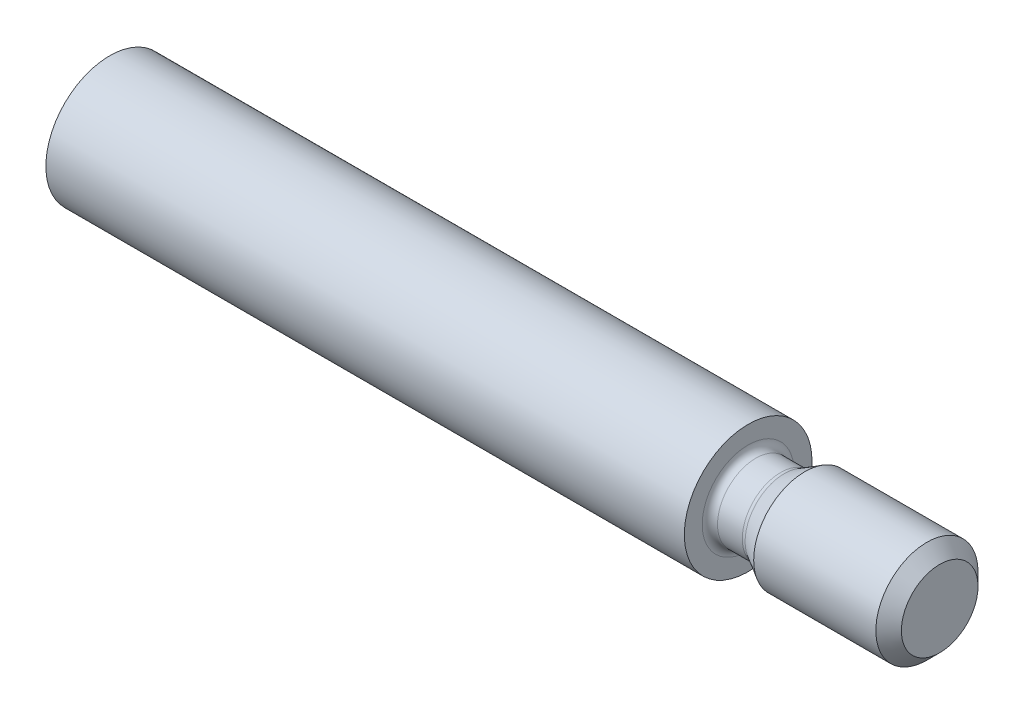
ISO-10303-21;
HEADER;
FILE_DESCRIPTION(('STEP AP214'),'2;1');
FILE_NAME('part.step','',(''),(''),'','','');
FILE_SCHEMA(('AUTOMOTIVE_DESIGN { 1 0 10303 214 1 1 1 1 }'));
ENDSEC;
DATA;
#1=APPLICATION_CONTEXT('core data for automotive mechanical design processes');
#2=APPLICATION_PROTOCOL_DEFINITION('international standard','automotive_design',2000,#1);
#3=PRODUCT_CONTEXT('',#1,'mechanical');
#4=PRODUCT('Part','Part','',(#3));
#5=PRODUCT_RELATED_PRODUCT_CATEGORY('part','',(#4));
#6=PRODUCT_DEFINITION_FORMATION('','',#4);
#7=PRODUCT_DEFINITION_CONTEXT('part definition',#1,'design');
#8=PRODUCT_DEFINITION('design','',#6,#7);
#9=PRODUCT_DEFINITION_SHAPE('','',#8);
#10=(LENGTH_UNIT() NAMED_UNIT(*) SI_UNIT(.MILLI.,.METRE.));
#11=(NAMED_UNIT(*) PLANE_ANGLE_UNIT() SI_UNIT($,.RADIAN.));
#12=(NAMED_UNIT(*) SI_UNIT($,.STERADIAN.) SOLID_ANGLE_UNIT());
#13=UNCERTAINTY_MEASURE_WITH_UNIT(LENGTH_MEASURE(1.E-05),#10,'distance_accuracy_value','');
#14=(GEOMETRIC_REPRESENTATION_CONTEXT(3) GLOBAL_UNCERTAINTY_ASSIGNED_CONTEXT((#13)) GLOBAL_UNIT_ASSIGNED_CONTEXT((#10,
#11,#12)) REPRESENTATION_CONTEXT('',''));
#15=CARTESIAN_POINT('',(0.,0.,0.));
#16=DIRECTION('',(0.,0.,1.));
#17=DIRECTION('',(1.,0.,0.));
#18=AXIS2_PLACEMENT_3D('',#15,#16,#17);
#19=CARTESIAN_POINT('',(50.,0.,0.));
#20=DIRECTION('',(-1.,0.,0.));
#21=DIRECTION('',(0.,0.,1.));
#22=AXIS2_PLACEMENT_3D('',#19,#20,#21);
#23=CYLINDRICAL_SURFACE('',#22,5.);
#24=CARTESIAN_POINT('',(50.,0.,0.));
#25=DIRECTION('',(1.,0.,0.));
#26=DIRECTION('',(0.,0.,-1.));
#27=AXIS2_PLACEMENT_3D('',#24,#25,#26);
#28=CIRCLE('',#27,5.);
#29=CARTESIAN_POINT('',(50.,0.,-5.));
#30=VERTEX_POINT('',#29);
#31=EDGE_CURVE('E62',#30,#30,#28,.T.);
#32=ORIENTED_EDGE('',*,*,#31,.F.);
#33=EDGE_LOOP('',(#32));
#34=FACE_BOUND('',#33,.T.);
#35=CARTESIAN_POINT('',(0.,0.,0.));
#36=DIRECTION('',(1.,0.,0.));
#37=DIRECTION('',(0.,0.,-1.));
#38=AXIS2_PLACEMENT_3D('',#35,#36,#37);
#39=CIRCLE('',#38,5.);
#40=CARTESIAN_POINT('',(0.,0.,-5.));
#41=VERTEX_POINT('',#40);
#42=EDGE_CURVE('E66',#41,#41,#39,.T.);
#43=ORIENTED_EDGE('',*,*,#42,.T.);
#44=EDGE_LOOP('',(#43));
#45=FACE_BOUND('',#44,.T.);
#46=ADVANCED_FACE('F36',(#34,#45),#23,.T.);
#47=CARTESIAN_POINT('',(50.,0.,0.));
#48=DIRECTION('',(1.,0.,0.));
#49=DIRECTION('',(0.,0.,-1.));
#50=AXIS2_PLACEMENT_3D('',#47,#48,#49);
#51=PLANE('',#50);
#52=CARTESIAN_POINT('',(50.,0.,0.));
#53=DIRECTION('',(1.,0.,0.));
#54=DIRECTION('',(0.,0.,-1.));
#55=AXIS2_PLACEMENT_3D('',#52,#53,#54);
#56=CIRCLE('',#55,3.6);
#57=CARTESIAN_POINT('',(50.,0.,-3.6));
#58=VERTEX_POINT('',#57);
#59=EDGE_CURVE('E11',#58,#58,#56,.F.);
#60=ORIENTED_EDGE('',*,*,#59,.T.);
#61=EDGE_LOOP('',(#60));
#62=FACE_BOUND('',#61,.T.);
#63=ORIENTED_EDGE('',*,*,#31,.T.);
#64=EDGE_LOOP('',(#63));
#65=FACE_BOUND('',#64,.T.);
#66=ADVANCED_FACE('F72',(#62,#65),#51,.T.);
#67=CARTESIAN_POINT('',(0.,0.,0.));
#68=DIRECTION('',(1.,0.,0.));
#69=DIRECTION('',(0.,0.,-1.));
#70=AXIS2_PLACEMENT_3D('',#67,#68,#69);
#71=PLANE('',#70);
#72=ORIENTED_EDGE('',*,*,#42,.F.);
#73=EDGE_LOOP('',(#72));
#74=FACE_BOUND('',#73,.T.);
#75=ADVANCED_FACE('F79',(#74),#71,.F.);
#76=CARTESIAN_POINT('',(52.7,0.,0.));
#77=DIRECTION('',(-1.,0.,0.));
#78=DIRECTION('',(0.,0.,1.));
#79=AXIS2_PLACEMENT_3D('',#76,#77,#78);
#80=CYLINDRICAL_SURFACE('',#79,3.);
#81=CARTESIAN_POINT('',(52.5392304845413,0.,0.));
#82=DIRECTION('',(-1.,0.,0.));
#83=DIRECTION('',(0.,0.,1.));
#84=AXIS2_PLACEMENT_3D('',#81,#82,#83);
#85=CIRCLE('',#84,3.);
#86=CARTESIAN_POINT('',(52.5392304845413,0.,3.));
#87=VERTEX_POINT('',#86);
#88=EDGE_CURVE('E47',#87,#87,#85,.T.);
#89=CARTESIAN_POINT('',(50.6,0.,0.));
#90=DIRECTION('',(1.,0.,0.));
#91=DIRECTION('',(0.,0.,-1.));
#92=AXIS2_PLACEMENT_3D('',#89,#90,#91);
#93=CIRCLE('',#92,3.);
#94=CARTESIAN_POINT('',(50.6,0.,3.));
#95=VERTEX_POINT('',#94);
#96=EDGE_CURVE('E51',#95,#95,#93,.T.);
#97=CARTESIAN_POINT('',(52.5392304845413,0.,3.));
#98=CARTESIAN_POINT('',(52.519030166994,0.,3.));
#99=CARTESIAN_POINT('',(52.4988298494467,0.,3.));
#100=CARTESIAN_POINT('',(52.4584292143521,0.,3.));
#101=CARTESIAN_POINT('',(52.4382288968048,0.,3.));
#102=CARTESIAN_POINT('',(52.3978282617102,0.,3.));
#103=CARTESIAN_POINT('',(52.3776279441629,0.,3.));
#104=CARTESIAN_POINT('',(52.3372273090683,0.,3.));
#105=CARTESIAN_POINT('',(52.317026991521,0.,3.));
#106=CARTESIAN_POINT('',(52.2766263564264,0.,3.));
#107=CARTESIAN_POINT('',(52.2564260388791,0.,3.));
#108=CARTESIAN_POINT('',(52.2160254037844,0.,3.));
#109=CARTESIAN_POINT('',(52.1958250862371,0.,3.));
#110=CARTESIAN_POINT('',(52.1554244511425,0.,3.));
#111=CARTESIAN_POINT('',(52.1352241335952,0.,3.));
#112=CARTESIAN_POINT('',(52.0948234985006,0.,3.));
#113=CARTESIAN_POINT('',(52.0746231809533,0.,3.));
#114=CARTESIAN_POINT('',(52.0342225458587,0.,3.));
#115=CARTESIAN_POINT('',(52.0140222283114,0.,3.));
#116=CARTESIAN_POINT('',(51.9736215932168,0.,3.));
#117=CARTESIAN_POINT('',(51.9534212756695,0.,3.));
#118=CARTESIAN_POINT('',(51.9130206405749,0.,3.));
#119=CARTESIAN_POINT('',(51.8928203230276,0.,3.));
#120=CARTESIAN_POINT('',(51.8524196879329,0.,3.));
#121=CARTESIAN_POINT('',(51.8322193703856,0.,3.));
#122=CARTESIAN_POINT('',(51.791818735291,0.,3.));
#123=CARTESIAN_POINT('',(51.7716184177437,0.,3.));
#124=CARTESIAN_POINT('',(51.7312177826491,0.,3.));
#125=CARTESIAN_POINT('',(51.7110174651018,0.,3.));
#126=CARTESIAN_POINT('',(51.6706168300072,0.,3.));
#127=CARTESIAN_POINT('',(51.6504165124599,0.,3.));
#128=CARTESIAN_POINT('',(51.6100158773653,0.,3.));
#129=CARTESIAN_POINT('',(51.589815559818,0.,3.));
#130=CARTESIAN_POINT('',(51.5494149247234,0.,3.));
#131=CARTESIAN_POINT('',(51.5292146071761,0.,3.));
#132=CARTESIAN_POINT('',(51.4888139720814,0.,3.));
#133=CARTESIAN_POINT('',(51.4686136545341,0.,3.));
#134=CARTESIAN_POINT('',(51.4282130194395,0.,3.));
#135=CARTESIAN_POINT('',(51.4080127018922,0.,3.));
#136=CARTESIAN_POINT('',(51.3676120667976,0.,3.));
#137=CARTESIAN_POINT('',(51.3474117492503,0.,3.));
#138=CARTESIAN_POINT('',(51.3070111141557,0.,3.));
#139=CARTESIAN_POINT('',(51.2868107966084,0.,3.));
#140=CARTESIAN_POINT('',(51.2464101615138,0.,3.));
#141=CARTESIAN_POINT('',(51.2262098439665,0.,3.));
#142=CARTESIAN_POINT('',(51.1858092088719,0.,3.));
#143=CARTESIAN_POINT('',(51.1656088913246,0.,3.));
#144=CARTESIAN_POINT('',(51.1252082562299,0.,3.));
#145=CARTESIAN_POINT('',(51.1050079386826,0.,3.));
#146=CARTESIAN_POINT('',(51.064607303588,0.,3.));
#147=CARTESIAN_POINT('',(51.0444069860407,0.,3.));
#148=CARTESIAN_POINT('',(51.0040063509461,0.,3.));
#149=CARTESIAN_POINT('',(50.9838060333988,0.,3.));
#150=CARTESIAN_POINT('',(50.9434053983042,0.,3.));
#151=CARTESIAN_POINT('',(50.9232050807569,0.,3.));
#152=CARTESIAN_POINT('',(50.8828044456623,0.,3.));
#153=CARTESIAN_POINT('',(50.862604128115,0.,3.));
#154=CARTESIAN_POINT('',(50.8222034930204,0.,3.));
#155=CARTESIAN_POINT('',(50.8020031754731,0.,3.));
#156=CARTESIAN_POINT('',(50.7616025403784,0.,3.));
#157=CARTESIAN_POINT('',(50.7414022228311,0.,3.));
#158=CARTESIAN_POINT('',(50.7010015877365,0.,3.));
#159=CARTESIAN_POINT('',(50.6808012701892,0.,3.));
#160=CARTESIAN_POINT('',(50.6404006350946,0.,3.));
#161=CARTESIAN_POINT('',(50.6202003175473,0.,3.));
#162=CARTESIAN_POINT('',(50.6,0.,3.));
#163=B_SPLINE_CURVE_WITH_KNOTS('',3,(#97,#98,#99,#100,#101,#102,#103,#104,#105,#106,#107,#108,
#109,#110,#111,#112,#113,#114,#115,#116,#117,#118,#119,#120,#121,#122,#123,#124,#125,#126,#127,
#128,#129,#130,#131,#132,#133,#134,#135,#136,#137,#138,#139,#140,#141,#142,#143,#144,#145,#146,
#147,#148,#149,#150,#151,#152,#153,#154,#155,#156,#157,#158,#159,#160,#161,#162),.UNSPECIFIED.,
.F.,.F.,(4,2,2,2,2,2,2,2,2,2,2,2,2,2,2,2,2,2,2,2,2,2,2,2,2,2,2,2,2,2,2,2,4),(0.,
0.0606009526419177,0.121201905283835,0.181802857925753,0.242403810567671,0.303004763209588,
0.363605715851506,0.424206668493417,0.484807621135334,0.545408573777252,0.60600952641917,
0.666610479061087,0.727211431703005,0.787812384344923,0.848413336986834,0.909014289628751,
0.969615242270669,1.03021619491259,1.0908171475545,1.15141810019642,1.21201905283833,
1.27262000548025,1.33322095812217,1.39382191076409,1.454422863406,1.51502381604792,
1.57562476868984,1.63622572133175,1.69682667397367,1.75742762661558,1.8180285792575,
1.87862953189942,1.93923048454134),.UNSPECIFIED.);
#164=EDGE_CURVE('BSEAM81',#87,#95,#163,.T.);
#165=ORIENTED_EDGE('',*,*,#88,.T.);
#166=ORIENTED_EDGE('',*,*,#96,.T.);
#167=ORIENTED_EDGE('',*,*,#164,.T.);
#168=ORIENTED_EDGE('',*,*,#164,.F.);
#169=EDGE_LOOP('',(#165,#167,#166,#168));
#170=FACE_BOUND('',#169,.T.);
#171=ADVANCED_FACE('F81',(#170),#80,.T.);
#172=CARTESIAN_POINT('',(52.7,0.,0.));
#173=DIRECTION('',(1.,0.,0.));
#174=DIRECTION('',(0.,0.,1.));
#175=AXIS2_PLACEMENT_3D('',#172,#173,#174);
#176=CONICAL_SURFACE('',#175,3.,0.523598775598299);
#177=CARTESIAN_POINT('',(52.8392304845413,0.,0.));
#178=DIRECTION('',(-1.,0.,0.));
#179=DIRECTION('',(0.,0.,1.));
#180=AXIS2_PLACEMENT_3D('',#177,#178,#179);
#181=CIRCLE('',#180,3.08038475772934);
#182=CARTESIAN_POINT('',(52.8392304845413,0.,3.08038475772934));
#183=VERTEX_POINT('',#182);
#184=EDGE_CURVE('E43',#183,#183,#181,.F.);
#185=ORIENTED_EDGE('',*,*,#184,.T.);
#186=EDGE_LOOP('',(#185));
#187=FACE_BOUND('',#186,.T.);
#188=CARTESIAN_POINT('',(54.4320508075689,0.,0.));
#189=DIRECTION('',(1.,0.,0.));
#190=DIRECTION('',(0.,0.,-1.));
#191=AXIS2_PLACEMENT_3D('',#188,#189,#190);
#192=CIRCLE('',#191,4.);
#193=CARTESIAN_POINT('',(54.4320508075689,0.,-4.));
#194=VERTEX_POINT('',#193);
#195=EDGE_CURVE('E63',#194,#194,#192,.F.);
#196=ORIENTED_EDGE('',*,*,#195,.T.);
#197=EDGE_LOOP('',(#196));
#198=FACE_BOUND('',#197,.T.);
#199=ADVANCED_FACE('F87',(#187,#198),#176,.T.);
#200=CARTESIAN_POINT('',(65.,0.,0.));
#201=DIRECTION('',(1.,0.,0.));
#202=DIRECTION('',(0.,0.,-1.));
#203=AXIS2_PLACEMENT_3D('',#200,#201,#202);
#204=PLANE('',#203);
#205=CARTESIAN_POINT('',(65.,0.,0.));
#206=DIRECTION('',(1.,0.,0.));
#207=DIRECTION('',(0.,0.,-1.));
#208=AXIS2_PLACEMENT_3D('',#205,#206,#207);
#209=CIRCLE('',#208,3.00000000000001);
#210=CARTESIAN_POINT('',(65.,0.,-3.00000000000001));
#211=VERTEX_POINT('',#210);
#212=EDGE_CURVE('E59',#211,#211,#209,.T.);
#213=ORIENTED_EDGE('',*,*,#212,.T.);
#214=EDGE_LOOP('',(#213));
#215=FACE_BOUND('',#214,.T.);
#216=ADVANCED_FACE('F129',(#215),#204,.T.);
#217=CARTESIAN_POINT('',(65.,0.,0.));
#218=DIRECTION('',(-1.,0.,0.));
#219=DIRECTION('',(0.,0.,1.));
#220=AXIS2_PLACEMENT_3D('',#217,#218,#219);
#221=CYLINDRICAL_SURFACE('',#220,4.);
#222=CARTESIAN_POINT('',(64.,0.,0.));
#223=DIRECTION('',(1.,0.,0.));
#224=DIRECTION('',(0.,0.,-1.));
#225=AXIS2_PLACEMENT_3D('',#222,#223,#224);
#226=CIRCLE('',#225,4.);
#227=CARTESIAN_POINT('',(64.,0.,-4.));
#228=VERTEX_POINT('',#227);
#229=EDGE_CURVE('E56',#228,#228,#226,.F.);
#230=ORIENTED_EDGE('',*,*,#229,.T.);
#231=EDGE_LOOP('',(#230));
#232=FACE_BOUND('',#231,.T.);
#233=ORIENTED_EDGE('',*,*,#195,.F.);
#234=EDGE_LOOP('',(#233));
#235=FACE_BOUND('',#234,.T.);
#236=ADVANCED_FACE('F96',(#232,#235),#221,.T.);
#237=CARTESIAN_POINT('',(65.,0.,0.));
#238=DIRECTION('',(-1.,0.,0.));
#239=DIRECTION('',(0.,0.,1.));
#240=AXIS2_PLACEMENT_3D('',#237,#238,#239);
#241=CONICAL_SURFACE('',#240,3.00000000000001,0.78539816339745);
#242=ORIENTED_EDGE('',*,*,#229,.F.);
#243=EDGE_LOOP('',(#242));
#244=FACE_BOUND('',#243,.T.);
#245=ORIENTED_EDGE('',*,*,#212,.F.);
#246=EDGE_LOOP('',(#245));
#247=FACE_BOUND('',#246,.T.);
#248=ADVANCED_FACE('F93',(#244,#247),#241,.T.);
#249=CARTESIAN_POINT('',(52.5392304845413,0.,0.));
#250=DIRECTION('',(-1.,0.,0.));
#251=DIRECTION('',(0.,0.,1.));
#252=AXIS2_PLACEMENT_3D('',#249,#250,#251);
#253=TOROIDAL_SURFACE('',#252,3.6,0.6);
#254=ORIENTED_EDGE('',*,*,#184,.F.);
#255=EDGE_LOOP('',(#254));
#256=FACE_BOUND('',#255,.T.);
#257=ORIENTED_EDGE('',*,*,#88,.F.);
#258=EDGE_LOOP('',(#257));
#259=FACE_BOUND('',#258,.T.);
#260=ADVANCED_FACE('F95',(#256,#259),#253,.F.);
#261=CARTESIAN_POINT('',(50.6,0.,0.));
#262=DIRECTION('',(1.,0.,0.));
#263=DIRECTION('',(0.,0.,-1.));
#264=AXIS2_PLACEMENT_3D('',#261,#262,#263);
#265=TOROIDAL_SURFACE('',#264,3.6,0.6);
#266=ORIENTED_EDGE('',*,*,#59,.F.);
#267=EDGE_LOOP('',(#266));
#268=FACE_BOUND('',#267,.T.);
#269=ORIENTED_EDGE('',*,*,#96,.F.);
#270=EDGE_LOOP('',(#269));
#271=FACE_BOUND('',#270,.T.);
#272=ADVANCED_FACE('F38',(#268,#271),#265,.F.);
#273=CLOSED_SHELL('',(#46,#66,#75,#171,#199,#216,#236,#248,#260,#272));
#274=MANIFOLD_SOLID_BREP('B2',#273);
#275=ADVANCED_BREP_SHAPE_REPRESENTATION('',(#18,#274),#14);
#276=SHAPE_DEFINITION_REPRESENTATION(#9,#275);
ENDSEC;
END-ISO-10303-21;
